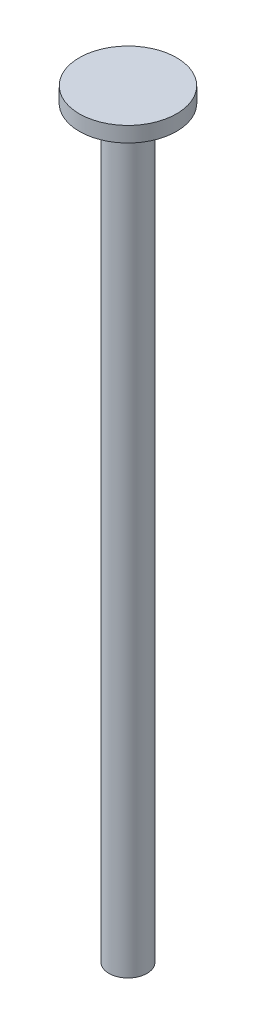
ISO-10303-21;
HEADER;
FILE_DESCRIPTION(('STEP AP214'),'2;1');
FILE_NAME('part.step','',(''),(''),'','','');
FILE_SCHEMA(('AUTOMOTIVE_DESIGN { 1 0 10303 214 1 1 1 1 }'));
ENDSEC;
DATA;
#1=APPLICATION_CONTEXT('core data for automotive mechanical design processes');
#2=APPLICATION_PROTOCOL_DEFINITION('international standard','automotive_design',2000,#1);
#3=PRODUCT_CONTEXT('',#1,'mechanical');
#4=PRODUCT('Part','Part','',(#3));
#5=PRODUCT_RELATED_PRODUCT_CATEGORY('part','',(#4));
#6=PRODUCT_DEFINITION_FORMATION('','',#4);
#7=PRODUCT_DEFINITION_CONTEXT('part definition',#1,'design');
#8=PRODUCT_DEFINITION('design','',#6,#7);
#9=PRODUCT_DEFINITION_SHAPE('','',#8);
#10=(LENGTH_UNIT() NAMED_UNIT(*) SI_UNIT(.MILLI.,.METRE.));
#11=(NAMED_UNIT(*) PLANE_ANGLE_UNIT() SI_UNIT($,.RADIAN.));
#12=(NAMED_UNIT(*) SI_UNIT($,.STERADIAN.) SOLID_ANGLE_UNIT());
#13=UNCERTAINTY_MEASURE_WITH_UNIT(LENGTH_MEASURE(1.E-05),#10,'distance_accuracy_value','');
#14=(GEOMETRIC_REPRESENTATION_CONTEXT(3) GLOBAL_UNCERTAINTY_ASSIGNED_CONTEXT((#13)) GLOBAL_UNIT_ASSIGNED_CONTEXT((#10,
#11,#12)) REPRESENTATION_CONTEXT('',''));
#15=CARTESIAN_POINT('',(0.,0.,0.));
#16=DIRECTION('',(0.,0.,1.));
#17=DIRECTION('',(1.,0.,0.));
#18=AXIS2_PLACEMENT_3D('',#15,#16,#17);
#19=CARTESIAN_POINT('',(0.,78.,0.));
#20=DIRECTION('',(0.,-1.,0.));
#21=DIRECTION('',(0.,0.,-1.));
#22=AXIS2_PLACEMENT_3D('',#19,#20,#21);
#23=CYLINDRICAL_SURFACE('',#22,2.);
#24=CARTESIAN_POINT('',(0.,78.,0.));
#25=DIRECTION('',(0.,1.,0.));
#26=DIRECTION('',(0.,0.,1.));
#27=AXIS2_PLACEMENT_3D('',#24,#25,#26);
#28=CIRCLE('',#27,2.);
#29=CARTESIAN_POINT('',(0.,78.,2.));
#30=VERTEX_POINT('',#29);
#31=EDGE_CURVE('E10',#30,#30,#28,.T.);
#32=ORIENTED_EDGE('',*,*,#31,.F.);
#33=EDGE_LOOP('',(#32));
#34=FACE_BOUND('',#33,.T.);
#35=CARTESIAN_POINT('',(0.,0.,0.));
#36=DIRECTION('',(0.,1.,0.));
#37=DIRECTION('',(0.,0.,1.));
#38=AXIS2_PLACEMENT_3D('',#35,#36,#37);
#39=CIRCLE('',#38,2.);
#40=CARTESIAN_POINT('',(0.,0.,2.));
#41=VERTEX_POINT('',#40);
#42=EDGE_CURVE('E37',#41,#41,#39,.T.);
#43=ORIENTED_EDGE('',*,*,#42,.T.);
#44=EDGE_LOOP('',(#43));
#45=FACE_BOUND('',#44,.T.);
#46=ADVANCED_FACE('F34',(#34,#45),#23,.T.);
#47=CARTESIAN_POINT('',(0.,0.,0.));
#48=DIRECTION('',(0.,1.,0.));
#49=DIRECTION('',(0.,0.,1.));
#50=AXIS2_PLACEMENT_3D('',#47,#48,#49);
#51=PLANE('',#50);
#52=ORIENTED_EDGE('',*,*,#42,.F.);
#53=EDGE_LOOP('',(#52));
#54=FACE_BOUND('',#53,.T.);
#55=ADVANCED_FACE('F66',(#54),#51,.F.);
#56=CARTESIAN_POINT('',(0.,78.,0.));
#57=DIRECTION('',(0.,1.,0.));
#58=DIRECTION('',(0.,0.,1.));
#59=AXIS2_PLACEMENT_3D('',#56,#57,#58);
#60=PLANE('',#59);
#61=CARTESIAN_POINT('',(0.,78.,0.));
#62=DIRECTION('',(0.,1.,0.));
#63=DIRECTION('',(0.,0.,1.));
#64=AXIS2_PLACEMENT_3D('',#61,#62,#63);
#65=CIRCLE('',#64,5.1);
#66=CARTESIAN_POINT('',(0.,78.,5.1));
#67=VERTEX_POINT('',#66);
#68=EDGE_CURVE('E49',#67,#67,#65,.T.);
#69=ORIENTED_EDGE('',*,*,#68,.F.);
#70=EDGE_LOOP('',(#69));
#71=FACE_BOUND('',#70,.T.);
#72=ORIENTED_EDGE('',*,*,#31,.T.);
#73=EDGE_LOOP('',(#72));
#74=FACE_BOUND('',#73,.T.);
#75=ADVANCED_FACE('F61',(#71,#74),#60,.F.);
#76=CARTESIAN_POINT('',(0.,79.6,0.));
#77=DIRECTION('',(0.,-1.,0.));
#78=DIRECTION('',(0.,0.,-1.));
#79=AXIS2_PLACEMENT_3D('',#76,#77,#78);
#80=CYLINDRICAL_SURFACE('',#79,5.1);
#81=CARTESIAN_POINT('',(0.,79.6,0.));
#82=DIRECTION('',(0.,1.,0.));
#83=DIRECTION('',(0.,0.,1.));
#84=AXIS2_PLACEMENT_3D('',#81,#82,#83);
#85=CIRCLE('',#84,5.1);
#86=CARTESIAN_POINT('',(0.,79.6,5.1));
#87=VERTEX_POINT('',#86);
#88=EDGE_CURVE('E47',#87,#87,#85,.T.);
#89=ORIENTED_EDGE('',*,*,#88,.F.);
#90=EDGE_LOOP('',(#89));
#91=FACE_BOUND('',#90,.T.);
#92=ORIENTED_EDGE('',*,*,#68,.T.);
#93=EDGE_LOOP('',(#92));
#94=FACE_BOUND('',#93,.T.);
#95=ADVANCED_FACE('F58',(#91,#94),#80,.T.);
#96=CARTESIAN_POINT('',(0.,79.6,0.));
#97=DIRECTION('',(0.,1.,0.));
#98=DIRECTION('',(0.,0.,1.));
#99=AXIS2_PLACEMENT_3D('',#96,#97,#98);
#100=PLANE('',#99);
#101=ORIENTED_EDGE('',*,*,#88,.T.);
#102=EDGE_LOOP('',(#101));
#103=FACE_BOUND('',#102,.T.);
#104=ADVANCED_FACE('F56',(#103),#100,.T.);
#105=CLOSED_SHELL('',(#46,#55,#75,#95,#104));
#106=MANIFOLD_SOLID_BREP('B2',#105);
#107=ADVANCED_BREP_SHAPE_REPRESENTATION('',(#18,#106),#14);
#108=SHAPE_DEFINITION_REPRESENTATION(#9,#107);
ENDSEC;
END-ISO-10303-21;
